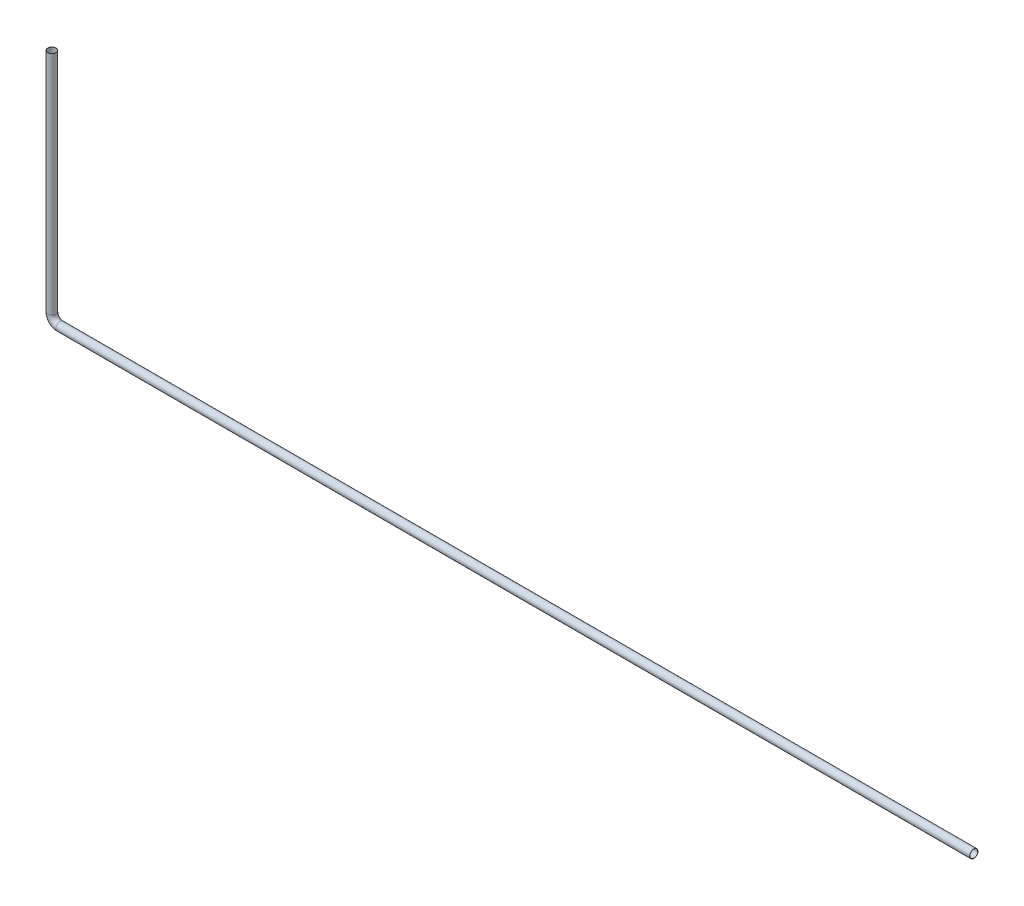
ISO-10303-21;
HEADER;
FILE_DESCRIPTION(('STEP AP214'),'2;1');
FILE_NAME('part.step','',(''),(''),'','','');
FILE_SCHEMA(('AUTOMOTIVE_DESIGN { 1 0 10303 214 1 1 1 1 }'));
ENDSEC;
DATA;
#1=APPLICATION_CONTEXT('core data for automotive mechanical design processes');
#2=APPLICATION_PROTOCOL_DEFINITION('international standard','automotive_design',2000,#1);
#3=PRODUCT_CONTEXT('',#1,'mechanical');
#4=PRODUCT('Part','Part','',(#3));
#5=PRODUCT_RELATED_PRODUCT_CATEGORY('part','',(#4));
#6=PRODUCT_DEFINITION_FORMATION('','',#4);
#7=PRODUCT_DEFINITION_CONTEXT('part definition',#1,'design');
#8=PRODUCT_DEFINITION('design','',#6,#7);
#9=PRODUCT_DEFINITION_SHAPE('','',#8);
#10=(LENGTH_UNIT() NAMED_UNIT(*) SI_UNIT(.MILLI.,.METRE.));
#11=(NAMED_UNIT(*) PLANE_ANGLE_UNIT() SI_UNIT($,.RADIAN.));
#12=(NAMED_UNIT(*) SI_UNIT($,.STERADIAN.) SOLID_ANGLE_UNIT());
#13=UNCERTAINTY_MEASURE_WITH_UNIT(LENGTH_MEASURE(1.E-05),#10,'distance_accuracy_value','');
#14=(GEOMETRIC_REPRESENTATION_CONTEXT(3) GLOBAL_UNCERTAINTY_ASSIGNED_CONTEXT((#13)) GLOBAL_UNIT_ASSIGNED_CONTEXT((#10,
#11,#12)) REPRESENTATION_CONTEXT('',''));
#15=CARTESIAN_POINT('',(0.,0.,0.));
#16=DIRECTION('',(0.,0.,1.));
#17=DIRECTION('',(1.,0.,0.));
#18=AXIS2_PLACEMENT_3D('',#15,#16,#17);
#19=CARTESIAN_POINT('',(-31937.4492832491,-17211.1783607882,41573.1603812032));
#20=DIRECTION('',(0.,-1.,0.));
#21=DIRECTION('',(0.,0.,-1.));
#22=AXIS2_PLACEMENT_3D('',#19,#20,#21);
#23=PLANE('',#22);
#24=CARTESIAN_POINT('',(-31937.4492832491,-17211.1783607882,41573.1603812032));
#25=DIRECTION('',(0.,-1.,0.));
#26=DIRECTION('',(0.,0.,-1.));
#27=AXIS2_PLACEMENT_3D('',#24,#25,#26);
#28=CIRCLE('',#27,14.0000000000006);
#29=CARTESIAN_POINT('',(-31937.4492832491,-17211.1783607882,41559.1603812031));
#30=VERTEX_POINT('',#29);
#31=EDGE_CURVE('E70',#30,#30,#28,.T.);
#32=ORIENTED_EDGE('',*,*,#31,.T.);
#33=EDGE_LOOP('',(#32));
#34=FACE_BOUND('',#33,.T.);
#35=CARTESIAN_POINT('',(-31937.4492832491,-17211.1783607882,41573.1603812032));
#36=DIRECTION('',(0.,-1.,0.));
#37=DIRECTION('',(0.,0.,-1.));
#38=AXIS2_PLACEMENT_3D('',#35,#36,#37);
#39=CIRCLE('',#38,15.0000000000006);
#40=CARTESIAN_POINT('',(-31937.4492832491,-17211.1783607882,41558.1603812032));
#41=VERTEX_POINT('',#40);
#42=EDGE_CURVE('E61',#41,#41,#39,.T.);
#43=ORIENTED_EDGE('',*,*,#42,.F.);
#44=EDGE_LOOP('',(#43));
#45=FACE_BOUND('',#44,.T.);
#46=ADVANCED_FACE('F47',(#34,#45),#23,.F.);
#47=CARTESIAN_POINT('',(-28606.3297308511,-18059.1718417593,41573.1603812032));
#48=DIRECTION('',(1.,0.,0.));
#49=DIRECTION('',(0.,0.,-1.));
#50=AXIS2_PLACEMENT_3D('',#47,#48,#49);
#51=PLANE('',#50);
#52=CARTESIAN_POINT('',(-28606.3297308511,-18059.1718417593,41573.1603812032));
#53=DIRECTION('',(1.,0.,0.));
#54=DIRECTION('',(0.,0.,-1.));
#55=AXIS2_PLACEMENT_3D('',#52,#53,#54);
#56=CIRCLE('',#55,14.0000000000006);
#57=CARTESIAN_POINT('',(-28606.3297308511,-18059.1718417593,41559.1603812031));
#58=VERTEX_POINT('',#57);
#59=EDGE_CURVE('E66',#58,#58,#56,.T.);
#60=ORIENTED_EDGE('',*,*,#59,.F.);
#61=EDGE_LOOP('',(#60));
#62=FACE_BOUND('',#61,.T.);
#63=CARTESIAN_POINT('',(-28606.3297308511,-18059.1718417593,41573.1603812032));
#64=DIRECTION('',(1.,0.,0.));
#65=DIRECTION('',(0.,0.,-1.));
#66=AXIS2_PLACEMENT_3D('',#63,#64,#65);
#67=CIRCLE('',#66,15.0000000000006);
#68=CARTESIAN_POINT('',(-28606.3297308511,-18059.1718417593,41558.1603812032));
#69=VERTEX_POINT('',#68);
#70=EDGE_CURVE('E11',#69,#69,#67,.T.);
#71=ORIENTED_EDGE('',*,*,#70,.T.);
#72=EDGE_LOOP('',(#71));
#73=FACE_BOUND('',#72,.T.);
#74=ADVANCED_FACE('F106',(#62,#73),#51,.T.);
#75=CARTESIAN_POINT('',(-31937.4492832491,-17211.1783607882,41573.1603812032));
#76=DIRECTION('',(0.,-1.,0.));
#77=DIRECTION('',(0.,0.,-1.));
#78=AXIS2_PLACEMENT_3D('',#75,#76,#77);
#79=CYLINDRICAL_SURFACE('',#78,15.0000000000006);
#80=CARTESIAN_POINT('',(-31937.4492832491,-18029.1718417593,41573.1603812032));
#81=DIRECTION('',(0.,-1.,0.));
#82=DIRECTION('',(0.,0.,-1.));
#83=AXIS2_PLACEMENT_3D('',#80,#81,#82);
#84=CIRCLE('',#83,15.0000000000006);
#85=CARTESIAN_POINT('',(-31952.4492832491,-18029.1718417593,41573.1603812032));
#86=VERTEX_POINT('',#85);
#87=EDGE_CURVE('E57',#86,#86,#84,.T.);
#88=ORIENTED_EDGE('',*,*,#87,.F.);
#89=EDGE_LOOP('',(#88));
#90=FACE_BOUND('',#89,.T.);
#91=ORIENTED_EDGE('',*,*,#42,.T.);
#92=EDGE_LOOP('',(#91));
#93=FACE_BOUND('',#92,.T.);
#94=ADVANCED_FACE('F102',(#90,#93),#79,.T.);
#95=CARTESIAN_POINT('',(-31907.4492832491,-18029.1718417593,41573.1603812032));
#96=DIRECTION('',(0.,0.,1.));
#97=DIRECTION('',(1.,0.,0.));
#98=AXIS2_PLACEMENT_3D('',#95,#96,#97);
#99=TOROIDAL_SURFACE('',#98,30.0000000000011,15.0000000000006);
#100=CARTESIAN_POINT('',(-31907.4492832491,-18059.1718417593,41573.1603812032));
#101=DIRECTION('',(1.,0.,0.));
#102=DIRECTION('',(0.,0.,-1.));
#103=AXIS2_PLACEMENT_3D('',#100,#101,#102);
#104=CIRCLE('',#103,15.0000000000006);
#105=CARTESIAN_POINT('',(-31907.4492832491,-18074.1718417593,41573.1603812032));
#106=VERTEX_POINT('',#105);
#107=EDGE_CURVE('E53',#106,#106,#104,.T.);
#108=CARTESIAN_POINT('',(-31907.4492832491,-18029.1718417593,41573.1603812032));
#109=DIRECTION('',(0.,0.,1.));
#110=DIRECTION('',(1.,0.,0.));
#111=AXIS2_PLACEMENT_3D('',#108,#109,#110);
#112=CIRCLE('',#111,45.0000000000017);
#113=EDGE_CURVE('',#86,#106,#112,.T.);
#114=ORIENTED_EDGE('',*,*,#87,.T.);
#115=ORIENTED_EDGE('',*,*,#107,.F.);
#116=ORIENTED_EDGE('',*,*,#113,.T.);
#117=ORIENTED_EDGE('',*,*,#113,.F.);
#118=EDGE_LOOP('',(#114,#116,#115,#117));
#119=FACE_BOUND('',#118,.T.);
#120=ADVANCED_FACE('F96',(#119),#99,.T.);
#121=CARTESIAN_POINT('',(-31907.4492832491,-18059.1718417593,41573.1603812032));
#122=DIRECTION('',(1.,0.,0.));
#123=DIRECTION('',(0.,0.,-1.));
#124=AXIS2_PLACEMENT_3D('',#121,#122,#123);
#125=CYLINDRICAL_SURFACE('',#124,15.0000000000006);
#126=ORIENTED_EDGE('',*,*,#70,.F.);
#127=EDGE_LOOP('',(#126));
#128=FACE_BOUND('',#127,.T.);
#129=ORIENTED_EDGE('',*,*,#107,.T.);
#130=EDGE_LOOP('',(#129));
#131=FACE_BOUND('',#130,.T.);
#132=ADVANCED_FACE('F93',(#128,#131),#125,.T.);
#133=CARTESIAN_POINT('',(-31937.4492832491,-17211.1783607882,41573.1603812032));
#134=DIRECTION('',(0.,-1.,0.));
#135=DIRECTION('',(0.,0.,-1.));
#136=AXIS2_PLACEMENT_3D('',#133,#134,#135);
#137=CYLINDRICAL_SURFACE('',#136,14.0000000000006);
#138=CARTESIAN_POINT('',(-31937.4492832491,-18029.1718417593,41573.1603812032));
#139=DIRECTION('',(0.,1.,0.));
#140=DIRECTION('',(-1.,0.,0.));
#141=AXIS2_PLACEMENT_3D('',#138,#139,#140);
#142=CIRCLE('',#141,14.0000000000006);
#143=CARTESIAN_POINT('',(-31951.4492832491,-18029.1718417593,41573.1603812032));
#144=VERTEX_POINT('',#143);
#145=EDGE_CURVE('E73',#144,#144,#142,.F.);
#146=ORIENTED_EDGE('',*,*,#145,.T.);
#147=EDGE_LOOP('',(#146));
#148=FACE_BOUND('',#147,.T.);
#149=ORIENTED_EDGE('',*,*,#31,.F.);
#150=EDGE_LOOP('',(#149));
#151=FACE_BOUND('',#150,.T.);
#152=ADVANCED_FACE('F79',(#148,#151),#137,.F.);
#153=CARTESIAN_POINT('',(-31907.4492832491,-18029.1718417593,41573.1603812032));
#154=DIRECTION('',(0.,0.,1.));
#155=DIRECTION('',(1.,0.,0.));
#156=AXIS2_PLACEMENT_3D('',#153,#154,#155);
#157=TOROIDAL_SURFACE('',#156,30.0000000000011,14.0000000000006);
#158=CARTESIAN_POINT('',(-31907.4492832491,-18059.1718417593,41573.1603812032));
#159=DIRECTION('',(1.,0.,0.));
#160=DIRECTION('',(0.,0.,-1.));
#161=AXIS2_PLACEMENT_3D('',#158,#159,#160);
#162=CIRCLE('',#161,14.0000000000006);
#163=CARTESIAN_POINT('',(-31907.4492832491,-18073.1718417593,41573.1603812032));
#164=VERTEX_POINT('',#163);
#165=EDGE_CURVE('E69',#164,#164,#162,.T.);
#166=CARTESIAN_POINT('',(-31907.4492832491,-18029.1718417593,41573.1603812032));
#167=DIRECTION('',(0.,0.,1.));
#168=DIRECTION('',(1.,0.,0.));
#169=AXIS2_PLACEMENT_3D('',#166,#167,#168);
#170=CIRCLE('',#169,44.0000000000017);
#171=EDGE_CURVE('',#144,#164,#170,.T.);
#172=ORIENTED_EDGE('',*,*,#145,.F.);
#173=ORIENTED_EDGE('',*,*,#165,.T.);
#174=ORIENTED_EDGE('',*,*,#171,.T.);
#175=ORIENTED_EDGE('',*,*,#171,.F.);
#176=EDGE_LOOP('',(#172,#174,#173,#175));
#177=FACE_BOUND('',#176,.T.);
#178=ADVANCED_FACE('F82',(#177),#157,.F.);
#179=CARTESIAN_POINT('',(-31907.4492832491,-18059.1718417593,41573.1603812032));
#180=DIRECTION('',(1.,0.,0.));
#181=DIRECTION('',(0.,0.,-1.));
#182=AXIS2_PLACEMENT_3D('',#179,#180,#181);
#183=CYLINDRICAL_SURFACE('',#182,14.0000000000006);
#184=ORIENTED_EDGE('',*,*,#59,.T.);
#185=EDGE_LOOP('',(#184));
#186=FACE_BOUND('',#185,.T.);
#187=ORIENTED_EDGE('',*,*,#165,.F.);
#188=EDGE_LOOP('',(#187));
#189=FACE_BOUND('',#188,.T.);
#190=ADVANCED_FACE('F84',(#186,#189),#183,.F.);
#191=CLOSED_SHELL('',(#46,#74,#94,#120,#132,#152,#178,#190));
#192=MANIFOLD_SOLID_BREP('B2',#191);
#193=ADVANCED_BREP_SHAPE_REPRESENTATION('',(#18,#192),#14);
#194=SHAPE_DEFINITION_REPRESENTATION(#9,#193);
ENDSEC;
END-ISO-10303-21;
